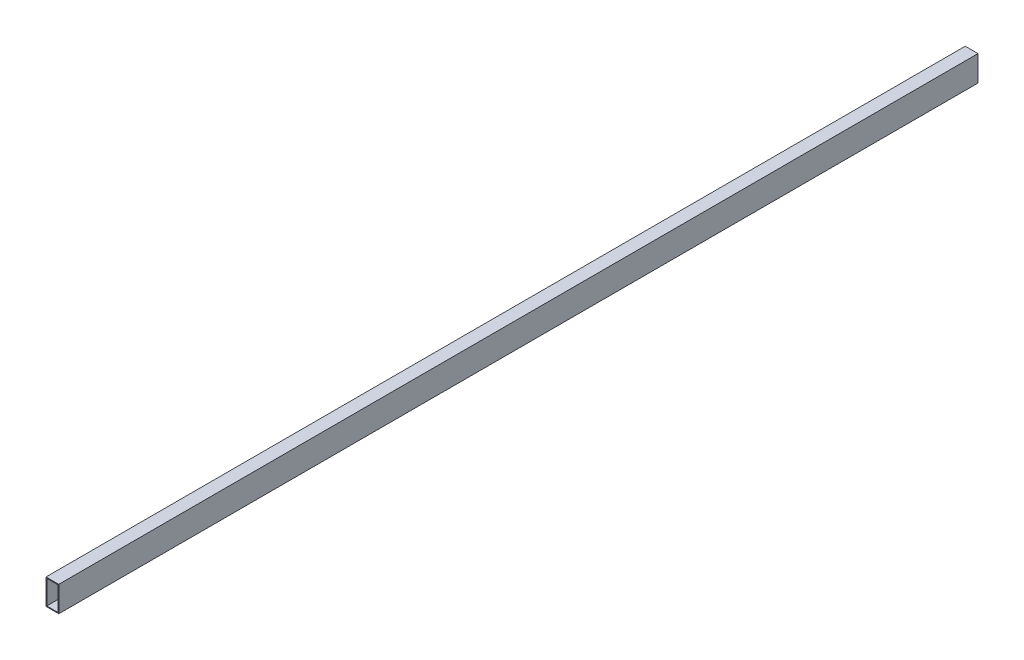
ISO-10303-21;
HEADER;
FILE_DESCRIPTION(('STEP AP214'),'2;1');
FILE_NAME('part.step','',(''),(''),'','','');
FILE_SCHEMA(('AUTOMOTIVE_DESIGN { 1 0 10303 214 1 1 1 1 }'));
ENDSEC;
DATA;
#1=APPLICATION_CONTEXT('core data for automotive mechanical design processes');
#2=APPLICATION_PROTOCOL_DEFINITION('international standard','automotive_design',2000,#1);
#3=PRODUCT_CONTEXT('',#1,'mechanical');
#4=PRODUCT('Part','Part','',(#3));
#5=PRODUCT_RELATED_PRODUCT_CATEGORY('part','',(#4));
#6=PRODUCT_DEFINITION_FORMATION('','',#4);
#7=PRODUCT_DEFINITION_CONTEXT('part definition',#1,'design');
#8=PRODUCT_DEFINITION('design','',#6,#7);
#9=PRODUCT_DEFINITION_SHAPE('','',#8);
#10=(LENGTH_UNIT() NAMED_UNIT(*) SI_UNIT(.MILLI.,.METRE.));
#11=(NAMED_UNIT(*) PLANE_ANGLE_UNIT() SI_UNIT($,.RADIAN.));
#12=(NAMED_UNIT(*) SI_UNIT($,.STERADIAN.) SOLID_ANGLE_UNIT());
#13=UNCERTAINTY_MEASURE_WITH_UNIT(LENGTH_MEASURE(1.E-05),#10,'distance_accuracy_value','');
#14=(GEOMETRIC_REPRESENTATION_CONTEXT(3) GLOBAL_UNCERTAINTY_ASSIGNED_CONTEXT((#13)) GLOBAL_UNIT_ASSIGNED_CONTEXT((#10,
#11,#12)) REPRESENTATION_CONTEXT('',''));
#15=CARTESIAN_POINT('',(0.,0.,0.));
#16=DIRECTION('',(0.,0.,1.));
#17=DIRECTION('',(1.,0.,0.));
#18=AXIS2_PLACEMENT_3D('',#15,#16,#17);
#19=CARTESIAN_POINT('',(11.0997999999691,-23.7997999999894,0.));
#20=DIRECTION('',(1.,0.,0.));
#21=DIRECTION('',(0.,0.,-1.));
#22=AXIS2_PLACEMENT_3D('',#19,#20,#21);
#23=PLANE('',#22);
#24=DIRECTION('',(0.,0.,-1.));
#25=VECTOR('',#24,1.);
#26=CARTESIAN_POINT('',(11.0997999999691,-23.7997999999894,0.));
#27=LINE('',#26,#25);
#28=CARTESIAN_POINT('',(11.0997999999691,-23.7997999999894,0.));
#29=VERTEX_POINT('',#28);
#30=CARTESIAN_POINT('',(11.0997999999691,-23.7997999999894,1828.8));
#31=VERTEX_POINT('',#30);
#32=EDGE_CURVE('E18',#29,#31,#27,.F.);
#33=ORIENTED_EDGE('',*,*,#32,.T.);
#34=DIRECTION('',(0.,1.,0.));
#35=VECTOR('',#34,1.);
#36=CARTESIAN_POINT('',(11.0997999999691,0.,1828.8));
#37=LINE('',#36,#35);
#38=CARTESIAN_POINT('',(11.0997999999691,23.7997999999894,1828.8));
#39=VERTEX_POINT('',#38);
#40=EDGE_CURVE('E123',#39,#31,#37,.F.);
#41=ORIENTED_EDGE('',*,*,#40,.F.);
#42=DIRECTION('',(0.,0.,1.));
#43=VECTOR('',#42,1.);
#44=CARTESIAN_POINT('',(11.0997999999691,23.7997999999894,0.));
#45=LINE('',#44,#43);
#46=CARTESIAN_POINT('',(11.0997999999691,23.7997999999894,0.));
#47=VERTEX_POINT('',#46);
#48=EDGE_CURVE('E108',#39,#47,#45,.F.);
#49=ORIENTED_EDGE('',*,*,#48,.T.);
#50=DIRECTION('',(0.,1.,0.));
#51=VECTOR('',#50,1.);
#52=CARTESIAN_POINT('',(11.0997999999691,0.,0.));
#53=LINE('',#52,#51);
#54=EDGE_CURVE('E103',#47,#29,#53,.F.);
#55=ORIENTED_EDGE('',*,*,#54,.T.);
#56=EDGE_LOOP('',(#33,#41,#49,#55));
#57=FACE_BOUND('',#56,.T.);
#58=ADVANCED_FACE('F15',(#57),#23,.F.);
#59=CARTESIAN_POINT('',(-11.0997999999691,-23.7997999999894,0.));
#60=DIRECTION('',(0.,-1.,0.));
#61=DIRECTION('',(0.,0.,-1.));
#62=AXIS2_PLACEMENT_3D('',#59,#60,#61);
#63=PLANE('',#62);
#64=DIRECTION('',(0.,0.,1.));
#65=VECTOR('',#64,1.);
#66=CARTESIAN_POINT('',(-11.0997999999691,-23.7997999999894,0.));
#67=LINE('',#66,#65);
#68=CARTESIAN_POINT('',(-11.0997999999691,-23.7997999999894,0.));
#69=VERTEX_POINT('',#68);
#70=CARTESIAN_POINT('',(-11.0997999999691,-23.7997999999894,1828.8));
#71=VERTEX_POINT('',#70);
#72=EDGE_CURVE('E82',#69,#71,#67,.T.);
#73=ORIENTED_EDGE('',*,*,#72,.T.);
#74=DIRECTION('',(1.,0.,0.));
#75=VECTOR('',#74,1.);
#76=CARTESIAN_POINT('',(0.,-23.7997999999894,1828.8));
#77=LINE('',#76,#75);
#78=EDGE_CURVE('E121',#31,#71,#77,.F.);
#79=ORIENTED_EDGE('',*,*,#78,.F.);
#80=ORIENTED_EDGE('',*,*,#32,.F.);
#81=DIRECTION('',(1.,0.,0.));
#82=VECTOR('',#81,1.);
#83=CARTESIAN_POINT('',(0.,-23.7997999999894,0.));
#84=LINE('',#83,#82);
#85=EDGE_CURVE('E79',#29,#69,#84,.F.);
#86=ORIENTED_EDGE('',*,*,#85,.T.);
#87=EDGE_LOOP('',(#73,#79,#80,#86));
#88=FACE_BOUND('',#87,.T.);
#89=ADVANCED_FACE('F81',(#88),#63,.F.);
#90=CARTESIAN_POINT('',(-11.0997999999691,23.7997999999894,0.));
#91=DIRECTION('',(-1.,0.,0.));
#92=DIRECTION('',(0.,0.,1.));
#93=AXIS2_PLACEMENT_3D('',#90,#91,#92);
#94=PLANE('',#93);
#95=DIRECTION('',(0.,0.,1.));
#96=VECTOR('',#95,1.);
#97=CARTESIAN_POINT('',(-11.0997999999691,23.7997999999894,0.));
#98=LINE('',#97,#96);
#99=CARTESIAN_POINT('',(-11.0997999999691,23.7997999999894,0.));
#100=VERTEX_POINT('',#99);
#101=CARTESIAN_POINT('',(-11.0997999999691,23.7997999999894,1828.8));
#102=VERTEX_POINT('',#101);
#103=EDGE_CURVE('E96',#100,#102,#98,.T.);
#104=ORIENTED_EDGE('',*,*,#103,.T.);
#105=DIRECTION('',(0.,1.,0.));
#106=VECTOR('',#105,1.);
#107=CARTESIAN_POINT('',(-11.0997999999691,0.,1828.8));
#108=LINE('',#107,#106);
#109=EDGE_CURVE('E94',#71,#102,#108,.T.);
#110=ORIENTED_EDGE('',*,*,#109,.F.);
#111=ORIENTED_EDGE('',*,*,#72,.F.);
#112=DIRECTION('',(0.,1.,0.));
#113=VECTOR('',#112,1.);
#114=CARTESIAN_POINT('',(-11.0997999999691,0.,0.));
#115=LINE('',#114,#113);
#116=EDGE_CURVE('E87',#69,#100,#115,.T.);
#117=ORIENTED_EDGE('',*,*,#116,.T.);
#118=EDGE_LOOP('',(#104,#110,#111,#117));
#119=FACE_BOUND('',#118,.T.);
#120=ADVANCED_FACE('F91',(#119),#94,.F.);
#121=CARTESIAN_POINT('',(11.0997999999691,23.7997999999894,0.));
#122=DIRECTION('',(0.,1.,0.));
#123=DIRECTION('',(0.,0.,1.));
#124=AXIS2_PLACEMENT_3D('',#121,#122,#123);
#125=PLANE('',#124);
#126=ORIENTED_EDGE('',*,*,#48,.F.);
#127=DIRECTION('',(1.,0.,0.));
#128=VECTOR('',#127,1.);
#129=CARTESIAN_POINT('',(0.,23.7997999999894,1828.8));
#130=LINE('',#129,#128);
#131=EDGE_CURVE('E114',#102,#39,#130,.T.);
#132=ORIENTED_EDGE('',*,*,#131,.F.);
#133=ORIENTED_EDGE('',*,*,#103,.F.);
#134=DIRECTION('',(1.,0.,0.));
#135=VECTOR('',#134,1.);
#136=CARTESIAN_POINT('',(0.,23.7997999999894,0.));
#137=LINE('',#136,#135);
#138=EDGE_CURVE('E101',#100,#47,#137,.T.);
#139=ORIENTED_EDGE('',*,*,#138,.T.);
#140=EDGE_LOOP('',(#126,#132,#133,#139));
#141=FACE_BOUND('',#140,.T.);
#142=ADVANCED_FACE('F115',(#141),#125,.F.);
#143=CARTESIAN_POINT('',(12.7,-25.4,0.));
#144=DIRECTION('',(1.,0.,0.));
#145=DIRECTION('',(0.,0.,-1.));
#146=AXIS2_PLACEMENT_3D('',#143,#144,#145);
#147=PLANE('',#146);
#148=DIRECTION('',(0.,1.,0.));
#149=VECTOR('',#148,1.);
#150=CARTESIAN_POINT('',(12.7,0.,1828.8));
#151=LINE('',#150,#149);
#152=CARTESIAN_POINT('',(12.7,-25.4,1828.8));
#153=VERTEX_POINT('',#152);
#154=CARTESIAN_POINT('',(12.7,25.4,1828.8));
#155=VERTEX_POINT('',#154);
#156=EDGE_CURVE('E128',#153,#155,#151,.T.);
#157=ORIENTED_EDGE('',*,*,#156,.F.);
#158=DIRECTION('',(0.,0.,-1.));
#159=VECTOR('',#158,1.);
#160=CARTESIAN_POINT('',(12.7,-25.4,0.));
#161=LINE('',#160,#159);
#162=CARTESIAN_POINT('',(12.7,-25.4,0.));
#163=VERTEX_POINT('',#162);
#164=EDGE_CURVE('E133',#163,#153,#161,.F.);
#165=ORIENTED_EDGE('',*,*,#164,.F.);
#166=DIRECTION('',(0.,1.,0.));
#167=VECTOR('',#166,1.);
#168=CARTESIAN_POINT('',(12.7,0.,0.));
#169=LINE('',#168,#167);
#170=CARTESIAN_POINT('',(12.7,25.4,0.));
#171=VERTEX_POINT('',#170);
#172=EDGE_CURVE('E88',#163,#171,#169,.T.);
#173=ORIENTED_EDGE('',*,*,#172,.T.);
#174=DIRECTION('',(0.,0.,1.));
#175=VECTOR('',#174,1.);
#176=CARTESIAN_POINT('',(12.7,25.4,0.));
#177=LINE('',#176,#175);
#178=EDGE_CURVE('E237',#155,#171,#177,.F.);
#179=ORIENTED_EDGE('',*,*,#178,.F.);
#180=EDGE_LOOP('',(#157,#165,#173,#179));
#181=FACE_BOUND('',#180,.T.);
#182=ADVANCED_FACE('F163',(#181),#147,.T.);
#183=CARTESIAN_POINT('',(0.,0.,0.));
#184=DIRECTION('',(0.,0.,1.));
#185=DIRECTION('',(1.,0.,0.));
#186=AXIS2_PLACEMENT_3D('',#183,#184,#185);
#187=PLANE('',#186);
#188=ORIENTED_EDGE('',*,*,#138,.F.);
#189=ORIENTED_EDGE('',*,*,#116,.F.);
#190=ORIENTED_EDGE('',*,*,#85,.F.);
#191=ORIENTED_EDGE('',*,*,#54,.F.);
#192=EDGE_LOOP('',(#188,#189,#190,#191));
#193=FACE_BOUND('',#192,.T.);
#194=DIRECTION('',(0.,1.,0.));
#195=VECTOR('',#194,1.);
#196=CARTESIAN_POINT('',(-12.7,25.4,0.));
#197=LINE('',#196,#195);
#198=CARTESIAN_POINT('',(-12.7,25.4,0.));
#199=VERTEX_POINT('',#198);
#200=CARTESIAN_POINT('',(-12.7,-25.4,0.));
#201=VERTEX_POINT('',#200);
#202=EDGE_CURVE('E243',#199,#201,#197,.F.);
#203=ORIENTED_EDGE('',*,*,#202,.F.);
#204=DIRECTION('',(1.,0.,0.));
#205=VECTOR('',#204,1.);
#206=CARTESIAN_POINT('',(12.7,25.4,0.));
#207=LINE('',#206,#205);
#208=EDGE_CURVE('E118',#171,#199,#207,.F.);
#209=ORIENTED_EDGE('',*,*,#208,.F.);
#210=ORIENTED_EDGE('',*,*,#172,.F.);
#211=DIRECTION('',(1.,0.,0.));
#212=VECTOR('',#211,1.);
#213=CARTESIAN_POINT('',(-12.7,-25.4,0.));
#214=LINE('',#213,#212);
#215=EDGE_CURVE('E135',#201,#163,#214,.T.);
#216=ORIENTED_EDGE('',*,*,#215,.F.);
#217=EDGE_LOOP('',(#203,#209,#210,#216));
#218=FACE_BOUND('',#217,.T.);
#219=ADVANCED_FACE('F98',(#193,#218),#187,.F.);
#220=CARTESIAN_POINT('',(-12.7,-25.4,0.));
#221=DIRECTION('',(0.,-1.,0.));
#222=DIRECTION('',(0.,0.,-1.));
#223=AXIS2_PLACEMENT_3D('',#220,#221,#222);
#224=PLANE('',#223);
#225=DIRECTION('',(1.,0.,0.));
#226=VECTOR('',#225,1.);
#227=CARTESIAN_POINT('',(0.,-25.4,1828.8));
#228=LINE('',#227,#226);
#229=CARTESIAN_POINT('',(-12.7,-25.4,1828.8));
#230=VERTEX_POINT('',#229);
#231=EDGE_CURVE('E130',#230,#153,#228,.T.);
#232=ORIENTED_EDGE('',*,*,#231,.F.);
#233=DIRECTION('',(0.,0.,1.));
#234=VECTOR('',#233,1.);
#235=CARTESIAN_POINT('',(-12.7,-25.4,0.));
#236=LINE('',#235,#234);
#237=EDGE_CURVE('E240',#201,#230,#236,.T.);
#238=ORIENTED_EDGE('',*,*,#237,.F.);
#239=ORIENTED_EDGE('',*,*,#215,.T.);
#240=ORIENTED_EDGE('',*,*,#164,.T.);
#241=EDGE_LOOP('',(#232,#238,#239,#240));
#242=FACE_BOUND('',#241,.T.);
#243=ADVANCED_FACE('F157',(#242),#224,.T.);
#244=CARTESIAN_POINT('',(0.,0.,1828.8));
#245=DIRECTION('',(0.,0.,1.));
#246=DIRECTION('',(1.,0.,0.));
#247=AXIS2_PLACEMENT_3D('',#244,#245,#246);
#248=PLANE('',#247);
#249=ORIENTED_EDGE('',*,*,#109,.T.);
#250=ORIENTED_EDGE('',*,*,#131,.T.);
#251=ORIENTED_EDGE('',*,*,#40,.T.);
#252=ORIENTED_EDGE('',*,*,#78,.T.);
#253=EDGE_LOOP('',(#249,#250,#251,#252));
#254=FACE_BOUND('',#253,.T.);
#255=DIRECTION('',(1.,0.,0.));
#256=VECTOR('',#255,1.);
#257=CARTESIAN_POINT('',(12.7,25.4,1828.8));
#258=LINE('',#257,#256);
#259=CARTESIAN_POINT('',(-12.7,25.4,1828.8));
#260=VERTEX_POINT('',#259);
#261=EDGE_CURVE('E33',#260,#155,#258,.T.);
#262=ORIENTED_EDGE('',*,*,#261,.F.);
#263=DIRECTION('',(0.,1.,0.));
#264=VECTOR('',#263,1.);
#265=CARTESIAN_POINT('',(-12.7,25.4,1828.8));
#266=LINE('',#265,#264);
#267=EDGE_CURVE('E24',#230,#260,#266,.T.);
#268=ORIENTED_EDGE('',*,*,#267,.F.);
#269=ORIENTED_EDGE('',*,*,#231,.T.);
#270=ORIENTED_EDGE('',*,*,#156,.T.);
#271=EDGE_LOOP('',(#262,#268,#269,#270));
#272=FACE_BOUND('',#271,.T.);
#273=ADVANCED_FACE('F120',(#254,#272),#248,.T.);
#274=CARTESIAN_POINT('',(12.7,25.4,0.));
#275=DIRECTION('',(0.,1.,0.));
#276=DIRECTION('',(0.,0.,1.));
#277=AXIS2_PLACEMENT_3D('',#274,#275,#276);
#278=PLANE('',#277);
#279=ORIENTED_EDGE('',*,*,#261,.T.);
#280=ORIENTED_EDGE('',*,*,#178,.T.);
#281=ORIENTED_EDGE('',*,*,#208,.T.);
#282=DIRECTION('',(0.,0.,1.));
#283=VECTOR('',#282,1.);
#284=CARTESIAN_POINT('',(-12.7,25.4,0.));
#285=LINE('',#284,#283);
#286=EDGE_CURVE('E9',#260,#199,#285,.F.);
#287=ORIENTED_EDGE('',*,*,#286,.F.);
#288=EDGE_LOOP('',(#279,#280,#281,#287));
#289=FACE_BOUND('',#288,.T.);
#290=ADVANCED_FACE('F145',(#289),#278,.T.);
#291=CARTESIAN_POINT('',(-12.7,25.4,0.));
#292=DIRECTION('',(-1.,0.,0.));
#293=DIRECTION('',(0.,0.,1.));
#294=AXIS2_PLACEMENT_3D('',#291,#292,#293);
#295=PLANE('',#294);
#296=ORIENTED_EDGE('',*,*,#267,.T.);
#297=ORIENTED_EDGE('',*,*,#286,.T.);
#298=ORIENTED_EDGE('',*,*,#202,.T.);
#299=ORIENTED_EDGE('',*,*,#237,.T.);
#300=EDGE_LOOP('',(#296,#297,#298,#299));
#301=FACE_BOUND('',#300,.T.);
#302=ADVANCED_FACE('F143',(#301),#295,.T.);
#303=CLOSED_SHELL('',(#58,#89,#120,#142,#182,#219,#243,#273,#290,#302));
#304=MANIFOLD_SOLID_BREP('B1',#303);
#305=ADVANCED_BREP_SHAPE_REPRESENTATION('',(#18,#304),#14);
#306=SHAPE_DEFINITION_REPRESENTATION(#9,#305);
ENDSEC;
END-ISO-10303-21;
